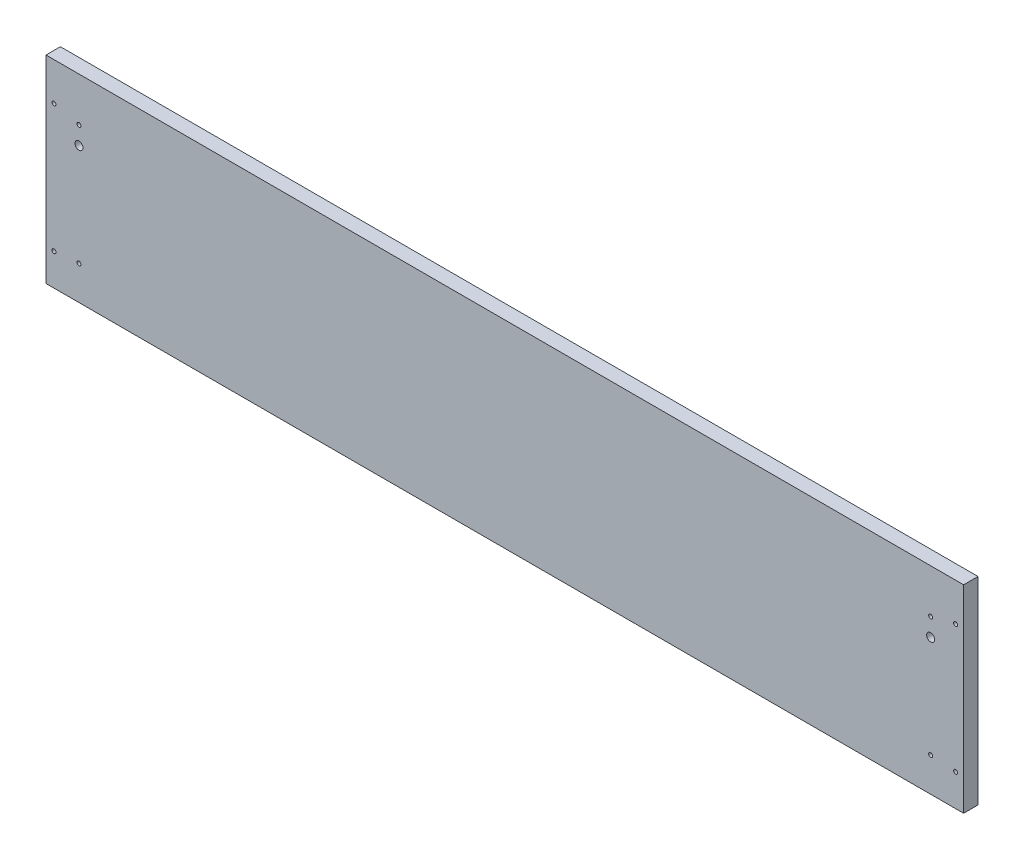
ISO-10303-21;
HEADER;
FILE_DESCRIPTION(('STEP AP214'),'2;1');
FILE_NAME('part.step','',(''),(''),'','','');
FILE_SCHEMA(('AUTOMOTIVE_DESIGN { 1 0 10303 214 1 1 1 1 }'));
ENDSEC;
DATA;
#1=APPLICATION_CONTEXT('core data for automotive mechanical design processes');
#2=APPLICATION_PROTOCOL_DEFINITION('international standard','automotive_design',2000,#1);
#3=PRODUCT_CONTEXT('',#1,'mechanical');
#4=PRODUCT('Part','Part','',(#3));
#5=PRODUCT_RELATED_PRODUCT_CATEGORY('part','',(#4));
#6=PRODUCT_DEFINITION_FORMATION('','',#4);
#7=PRODUCT_DEFINITION_CONTEXT('part definition',#1,'design');
#8=PRODUCT_DEFINITION('design','',#6,#7);
#9=PRODUCT_DEFINITION_SHAPE('','',#8);
#10=(LENGTH_UNIT() NAMED_UNIT(*) SI_UNIT(.MILLI.,.METRE.));
#11=(NAMED_UNIT(*) PLANE_ANGLE_UNIT() SI_UNIT($,.RADIAN.));
#12=(NAMED_UNIT(*) SI_UNIT($,.STERADIAN.) SOLID_ANGLE_UNIT());
#13=UNCERTAINTY_MEASURE_WITH_UNIT(LENGTH_MEASURE(1.E-05),#10,'distance_accuracy_value','');
#14=(GEOMETRIC_REPRESENTATION_CONTEXT(3) GLOBAL_UNCERTAINTY_ASSIGNED_CONTEXT((#13)) GLOBAL_UNIT_ASSIGNED_CONTEXT((#10,
#11,#12)) REPRESENTATION_CONTEXT('',''));
#15=CARTESIAN_POINT('',(0.,0.,0.));
#16=DIRECTION('',(0.,0.,1.));
#17=DIRECTION('',(1.,0.,0.));
#18=AXIS2_PLACEMENT_3D('',#15,#16,#17);
#19=CARTESIAN_POINT('',(-5740.4,1206.5,-11.43));
#20=DIRECTION('',(0.,-1.,0.));
#21=DIRECTION('',(0.,0.,-1.));
#22=AXIS2_PLACEMENT_3D('',#19,#20,#21);
#23=PLANE('',#22);
#24=DIRECTION('',(1.,0.,0.));
#25=VECTOR('',#24,1.);
#26=CARTESIAN_POINT('',(-5740.4,1206.5,0.));
#27=LINE('',#26,#25);
#28=CARTESIAN_POINT('',(-5740.4,1206.5,0.));
#29=VERTEX_POINT('',#28);
#30=CARTESIAN_POINT('',(-5011.7375,1206.5,0.));
#31=VERTEX_POINT('',#30);
#32=EDGE_CURVE('E96',#29,#31,#27,.T.);
#33=ORIENTED_EDGE('',*,*,#32,.F.);
#34=DIRECTION('',(0.,0.,1.));
#35=VECTOR('',#34,1.);
#36=CARTESIAN_POINT('',(-5740.4,1206.5,-11.43));
#37=LINE('',#36,#35);
#38=CARTESIAN_POINT('',(-5740.4,1206.5,-11.43));
#39=VERTEX_POINT('',#38);
#40=EDGE_CURVE('E11',#39,#29,#37,.T.);
#41=ORIENTED_EDGE('',*,*,#40,.F.);
#42=DIRECTION('',(1.,0.,0.));
#43=VECTOR('',#42,1.);
#44=CARTESIAN_POINT('',(-5740.4,1206.5,-11.43));
#45=LINE('',#44,#43);
#46=CARTESIAN_POINT('',(-5011.7375,1206.5,-11.43));
#47=VERTEX_POINT('',#46);
#48=EDGE_CURVE('E89',#39,#47,#45,.T.);
#49=ORIENTED_EDGE('',*,*,#48,.T.);
#50=DIRECTION('',(0.,0.,1.));
#51=VECTOR('',#50,1.);
#52=CARTESIAN_POINT('',(-5011.7375,1206.5,-11.43));
#53=LINE('',#52,#51);
#54=EDGE_CURVE('E34',#47,#31,#53,.T.);
#55=ORIENTED_EDGE('',*,*,#54,.T.);
#56=EDGE_LOOP('',(#33,#41,#49,#55));
#57=FACE_BOUND('',#56,.T.);
#58=ADVANCED_FACE('F31',(#57),#23,.T.);
#59=CARTESIAN_POINT('',(-5740.4,1363.6625,-11.43));
#60=DIRECTION('',(-1.,0.,0.));
#61=DIRECTION('',(0.,0.,1.));
#62=AXIS2_PLACEMENT_3D('',#59,#60,#61);
#63=PLANE('',#62);
#64=DIRECTION('',(0.,-1.,0.));
#65=VECTOR('',#64,1.);
#66=CARTESIAN_POINT('',(-5740.4,1363.6625,0.));
#67=LINE('',#66,#65);
#68=CARTESIAN_POINT('',(-5740.4,1363.6625,0.));
#69=VERTEX_POINT('',#68);
#70=EDGE_CURVE('E91',#69,#29,#67,.T.);
#71=ORIENTED_EDGE('',*,*,#70,.F.);
#72=DIRECTION('',(0.,0.,1.));
#73=VECTOR('',#72,1.);
#74=CARTESIAN_POINT('',(-5740.4,1363.6625,-11.43));
#75=LINE('',#74,#73);
#76=CARTESIAN_POINT('',(-5740.4,1363.6625,-11.43));
#77=VERTEX_POINT('',#76);
#78=EDGE_CURVE('E40',#77,#69,#75,.T.);
#79=ORIENTED_EDGE('',*,*,#78,.F.);
#80=DIRECTION('',(0.,-1.,0.));
#81=VECTOR('',#80,1.);
#82=CARTESIAN_POINT('',(-5740.4,1363.6625,-11.43));
#83=LINE('',#82,#81);
#84=EDGE_CURVE('E86',#77,#39,#83,.T.);
#85=ORIENTED_EDGE('',*,*,#84,.T.);
#86=ORIENTED_EDGE('',*,*,#40,.T.);
#87=EDGE_LOOP('',(#71,#79,#85,#86));
#88=FACE_BOUND('',#87,.T.);
#89=ADVANCED_FACE('F107',(#88),#63,.T.);
#90=CARTESIAN_POINT('',(-5011.7375,1363.6625,-11.43));
#91=DIRECTION('',(0.,1.,0.));
#92=DIRECTION('',(0.,0.,1.));
#93=AXIS2_PLACEMENT_3D('',#90,#91,#92);
#94=PLANE('',#93);
#95=DIRECTION('',(-1.,0.,0.));
#96=VECTOR('',#95,1.);
#97=CARTESIAN_POINT('',(-5011.7375,1363.6625,0.));
#98=LINE('',#97,#96);
#99=CARTESIAN_POINT('',(-5011.7375,1363.6625,0.));
#100=VERTEX_POINT('',#99);
#101=EDGE_CURVE('E81',#100,#69,#98,.T.);
#102=ORIENTED_EDGE('',*,*,#101,.F.);
#103=DIRECTION('',(0.,0.,1.));
#104=VECTOR('',#103,1.);
#105=CARTESIAN_POINT('',(-5011.7375,1363.6625,-11.43));
#106=LINE('',#105,#104);
#107=CARTESIAN_POINT('',(-5011.7375,1363.6625,-11.43));
#108=VERTEX_POINT('',#107);
#109=EDGE_CURVE('E76',#108,#100,#106,.T.);
#110=ORIENTED_EDGE('',*,*,#109,.F.);
#111=DIRECTION('',(-1.,0.,0.));
#112=VECTOR('',#111,1.);
#113=CARTESIAN_POINT('',(-5011.7375,1363.6625,-11.43));
#114=LINE('',#113,#112);
#115=EDGE_CURVE('E79',#108,#77,#114,.T.);
#116=ORIENTED_EDGE('',*,*,#115,.T.);
#117=ORIENTED_EDGE('',*,*,#78,.T.);
#118=EDGE_LOOP('',(#102,#110,#116,#117));
#119=FACE_BOUND('',#118,.T.);
#120=ADVANCED_FACE('F78',(#119),#94,.T.);
#121=CARTESIAN_POINT('',(-5011.7375,1206.5,-11.43));
#122=DIRECTION('',(1.,0.,0.));
#123=DIRECTION('',(0.,0.,-1.));
#124=AXIS2_PLACEMENT_3D('',#121,#122,#123);
#125=PLANE('',#124);
#126=DIRECTION('',(0.,1.,0.));
#127=VECTOR('',#126,1.);
#128=CARTESIAN_POINT('',(-5011.7375,1206.5,0.));
#129=LINE('',#128,#127);
#130=EDGE_CURVE('E99',#31,#100,#129,.T.);
#131=ORIENTED_EDGE('',*,*,#130,.F.);
#132=ORIENTED_EDGE('',*,*,#54,.F.);
#133=DIRECTION('',(0.,1.,0.));
#134=VECTOR('',#133,1.);
#135=CARTESIAN_POINT('',(-5011.7375,1206.5,-11.43));
#136=LINE('',#135,#134);
#137=EDGE_CURVE('E85',#47,#108,#136,.T.);
#138=ORIENTED_EDGE('',*,*,#137,.T.);
#139=ORIENTED_EDGE('',*,*,#109,.T.);
#140=EDGE_LOOP('',(#131,#132,#138,#139));
#141=FACE_BOUND('',#140,.T.);
#142=ADVANCED_FACE('F88',(#141),#125,.T.);
#143=CARTESIAN_POINT('',(-5011.7375,1206.5,-11.43));
#144=DIRECTION('',(0.,0.,1.));
#145=DIRECTION('',(1.,0.,0.));
#146=AXIS2_PLACEMENT_3D('',#143,#144,#145);
#147=PLANE('',#146);
#148=CARTESIAN_POINT('',(-5018.0875,1231.9,-11.43));
#149=DIRECTION('',(0.,0.,1.));
#150=DIRECTION('',(1.,0.,0.));
#151=AXIS2_PLACEMENT_3D('',#148,#149,#150);
#152=CIRCLE('',#151,1.58750000000051);
#153=CARTESIAN_POINT('',(-5016.5,1231.9,-11.43));
#154=VERTEX_POINT('',#153);
#155=EDGE_CURVE('E172',#154,#154,#152,.F.);
#156=ORIENTED_EDGE('',*,*,#155,.F.);
#157=EDGE_LOOP('',(#156));
#158=FACE_BOUND('',#157,.T.);
#159=CARTESIAN_POINT('',(-5037.93125,1233.4875,-11.43));
#160=DIRECTION('',(0.,0.,1.));
#161=DIRECTION('',(1.,0.,0.));
#162=AXIS2_PLACEMENT_3D('',#159,#160,#161);
#163=CIRCLE('',#162,1.58750000000051);
#164=CARTESIAN_POINT('',(-5036.34375,1233.4875,-11.43));
#165=VERTEX_POINT('',#164);
#166=EDGE_CURVE('E182',#165,#165,#163,.F.);
#167=ORIENTED_EDGE('',*,*,#166,.F.);
#168=EDGE_LOOP('',(#167));
#169=FACE_BOUND('',#168,.T.);
#170=CARTESIAN_POINT('',(-5018.0875,1333.5,-11.43));
#171=DIRECTION('',(0.,0.,1.));
#172=DIRECTION('',(1.,0.,0.));
#173=AXIS2_PLACEMENT_3D('',#170,#171,#172);
#174=CIRCLE('',#173,1.58750000000051);
#175=CARTESIAN_POINT('',(-5016.5,1333.5,-11.43));
#176=VERTEX_POINT('',#175);
#177=EDGE_CURVE('E188',#176,#176,#174,.F.);
#178=ORIENTED_EDGE('',*,*,#177,.F.);
#179=EDGE_LOOP('',(#178));
#180=FACE_BOUND('',#179,.T.);
#181=CARTESIAN_POINT('',(-5037.93125,1328.7375,-11.43));
#182=DIRECTION('',(0.,0.,1.));
#183=DIRECTION('',(1.,0.,0.));
#184=AXIS2_PLACEMENT_3D('',#181,#182,#183);
#185=CIRCLE('',#184,1.58750000000051);
#186=CARTESIAN_POINT('',(-5036.34375,1328.7375,-11.43));
#187=VERTEX_POINT('',#186);
#188=EDGE_CURVE('E194',#187,#187,#185,.F.);
#189=ORIENTED_EDGE('',*,*,#188,.F.);
#190=EDGE_LOOP('',(#189));
#191=FACE_BOUND('',#190,.T.);
#192=CARTESIAN_POINT('',(-5037.93125,1314.45,-11.43));
#193=DIRECTION('',(0.,0.,1.));
#194=DIRECTION('',(1.,0.,0.));
#195=AXIS2_PLACEMENT_3D('',#192,#193,#194);
#196=CIRCLE('',#195,3.17500000000004);
#197=CARTESIAN_POINT('',(-5034.75625,1314.45,-11.43));
#198=VERTEX_POINT('',#197);
#199=EDGE_CURVE('E200',#198,#198,#196,.F.);
#200=ORIENTED_EDGE('',*,*,#199,.F.);
#201=EDGE_LOOP('',(#200));
#202=FACE_BOUND('',#201,.T.);
#203=CARTESIAN_POINT('',(-5714.20625,1233.4875,-11.43));
#204=DIRECTION('',(0.,0.,1.));
#205=DIRECTION('',(1.,0.,0.));
#206=AXIS2_PLACEMENT_3D('',#203,#204,#205);
#207=CIRCLE('',#206,1.58750000000045);
#208=CARTESIAN_POINT('',(-5712.61875,1233.4875,-11.43));
#209=VERTEX_POINT('',#208);
#210=EDGE_CURVE('E206',#209,#209,#207,.F.);
#211=ORIENTED_EDGE('',*,*,#210,.F.);
#212=EDGE_LOOP('',(#211));
#213=FACE_BOUND('',#212,.T.);
#214=CARTESIAN_POINT('',(-5734.05,1231.9,-11.43));
#215=DIRECTION('',(0.,0.,1.));
#216=DIRECTION('',(1.,0.,0.));
#217=AXIS2_PLACEMENT_3D('',#214,#215,#216);
#218=CIRCLE('',#217,1.58750000000051);
#219=CARTESIAN_POINT('',(-5732.4625,1231.9,-11.43));
#220=VERTEX_POINT('',#219);
#221=EDGE_CURVE('E212',#220,#220,#218,.F.);
#222=ORIENTED_EDGE('',*,*,#221,.F.);
#223=EDGE_LOOP('',(#222));
#224=FACE_BOUND('',#223,.T.);
#225=CARTESIAN_POINT('',(-5734.05,1333.5,-11.43));
#226=DIRECTION('',(0.,0.,1.));
#227=DIRECTION('',(1.,0.,0.));
#228=AXIS2_PLACEMENT_3D('',#225,#226,#227);
#229=CIRCLE('',#228,1.58750000000051);
#230=CARTESIAN_POINT('',(-5732.4625,1333.5,-11.43));
#231=VERTEX_POINT('',#230);
#232=EDGE_CURVE('E218',#231,#231,#229,.F.);
#233=ORIENTED_EDGE('',*,*,#232,.F.);
#234=EDGE_LOOP('',(#233));
#235=FACE_BOUND('',#234,.T.);
#236=CARTESIAN_POINT('',(-5714.20625,1328.7375,-11.43));
#237=DIRECTION('',(0.,0.,1.));
#238=DIRECTION('',(1.,0.,0.));
#239=AXIS2_PLACEMENT_3D('',#236,#237,#238);
#240=CIRCLE('',#239,1.5874999999996);
#241=CARTESIAN_POINT('',(-5712.61875,1328.7375,-11.43));
#242=VERTEX_POINT('',#241);
#243=EDGE_CURVE('E224',#242,#242,#240,.F.);
#244=ORIENTED_EDGE('',*,*,#243,.F.);
#245=EDGE_LOOP('',(#244));
#246=FACE_BOUND('',#245,.T.);
#247=CARTESIAN_POINT('',(-5714.20625,1314.45,-11.43));
#248=DIRECTION('',(0.,0.,1.));
#249=DIRECTION('',(1.,0.,0.));
#250=AXIS2_PLACEMENT_3D('',#247,#248,#249);
#251=CIRCLE('',#250,3.1749999999992);
#252=CARTESIAN_POINT('',(-5711.03125,1314.45,-11.43));
#253=VERTEX_POINT('',#252);
#254=EDGE_CURVE('E100',#253,#253,#251,.F.);
#255=ORIENTED_EDGE('',*,*,#254,.F.);
#256=EDGE_LOOP('',(#255));
#257=FACE_BOUND('',#256,.T.);
#258=ORIENTED_EDGE('',*,*,#48,.F.);
#259=ORIENTED_EDGE('',*,*,#84,.F.);
#260=ORIENTED_EDGE('',*,*,#115,.F.);
#261=ORIENTED_EDGE('',*,*,#137,.F.);
#262=EDGE_LOOP('',(#258,#259,#260,#261));
#263=FACE_BOUND('',#262,.T.);
#264=ADVANCED_FACE('F84',(#158,#169,#180,#191,#202,#213,#224,#235,#246,#257,#263),#147,.F.);
#265=CARTESIAN_POINT('',(-5011.7375,1206.5,0.));
#266=DIRECTION('',(0.,0.,1.));
#267=DIRECTION('',(1.,0.,0.));
#268=AXIS2_PLACEMENT_3D('',#265,#266,#267);
#269=PLANE('',#268);
#270=CARTESIAN_POINT('',(-5018.0875,1231.9,0.));
#271=DIRECTION('',(0.,0.,1.));
#272=DIRECTION('',(1.,0.,0.));
#273=AXIS2_PLACEMENT_3D('',#270,#271,#272);
#274=CIRCLE('',#273,1.58750000000051);
#275=CARTESIAN_POINT('',(-5016.5,1231.9,0.));
#276=VERTEX_POINT('',#275);
#277=EDGE_CURVE('E175',#276,#276,#274,.T.);
#278=ORIENTED_EDGE('',*,*,#277,.F.);
#279=EDGE_LOOP('',(#278));
#280=FACE_BOUND('',#279,.T.);
#281=CARTESIAN_POINT('',(-5037.93125,1233.4875,0.));
#282=DIRECTION('',(0.,0.,1.));
#283=DIRECTION('',(1.,0.,0.));
#284=AXIS2_PLACEMENT_3D('',#281,#282,#283);
#285=CIRCLE('',#284,1.58750000000051);
#286=CARTESIAN_POINT('',(-5036.34375,1233.4875,0.));
#287=VERTEX_POINT('',#286);
#288=EDGE_CURVE('E177',#287,#287,#285,.T.);
#289=ORIENTED_EDGE('',*,*,#288,.F.);
#290=EDGE_LOOP('',(#289));
#291=FACE_BOUND('',#290,.T.);
#292=CARTESIAN_POINT('',(-5018.0875,1333.5,0.));
#293=DIRECTION('',(0.,0.,1.));
#294=DIRECTION('',(1.,0.,0.));
#295=AXIS2_PLACEMENT_3D('',#292,#293,#294);
#296=CIRCLE('',#295,1.58750000000051);
#297=CARTESIAN_POINT('',(-5016.5,1333.5,0.));
#298=VERTEX_POINT('',#297);
#299=EDGE_CURVE('E185',#298,#298,#296,.T.);
#300=ORIENTED_EDGE('',*,*,#299,.F.);
#301=EDGE_LOOP('',(#300));
#302=FACE_BOUND('',#301,.T.);
#303=CARTESIAN_POINT('',(-5037.93125,1328.7375,0.));
#304=DIRECTION('',(0.,0.,1.));
#305=DIRECTION('',(1.,0.,0.));
#306=AXIS2_PLACEMENT_3D('',#303,#304,#305);
#307=CIRCLE('',#306,1.58750000000051);
#308=CARTESIAN_POINT('',(-5036.34375,1328.7375,0.));
#309=VERTEX_POINT('',#308);
#310=EDGE_CURVE('E191',#309,#309,#307,.T.);
#311=ORIENTED_EDGE('',*,*,#310,.F.);
#312=EDGE_LOOP('',(#311));
#313=FACE_BOUND('',#312,.T.);
#314=CARTESIAN_POINT('',(-5037.93125,1314.45,0.));
#315=DIRECTION('',(0.,0.,1.));
#316=DIRECTION('',(1.,0.,0.));
#317=AXIS2_PLACEMENT_3D('',#314,#315,#316);
#318=CIRCLE('',#317,3.17500000000004);
#319=CARTESIAN_POINT('',(-5034.75625,1314.45,0.));
#320=VERTEX_POINT('',#319);
#321=EDGE_CURVE('E197',#320,#320,#318,.T.);
#322=ORIENTED_EDGE('',*,*,#321,.F.);
#323=EDGE_LOOP('',(#322));
#324=FACE_BOUND('',#323,.T.);
#325=CARTESIAN_POINT('',(-5714.20625,1233.4875,0.));
#326=DIRECTION('',(0.,0.,1.));
#327=DIRECTION('',(1.,0.,0.));
#328=AXIS2_PLACEMENT_3D('',#325,#326,#327);
#329=CIRCLE('',#328,1.58750000000045);
#330=CARTESIAN_POINT('',(-5712.61875,1233.4875,0.));
#331=VERTEX_POINT('',#330);
#332=EDGE_CURVE('E203',#331,#331,#329,.T.);
#333=ORIENTED_EDGE('',*,*,#332,.F.);
#334=EDGE_LOOP('',(#333));
#335=FACE_BOUND('',#334,.T.);
#336=CARTESIAN_POINT('',(-5734.05,1231.9,0.));
#337=DIRECTION('',(0.,0.,1.));
#338=DIRECTION('',(1.,0.,0.));
#339=AXIS2_PLACEMENT_3D('',#336,#337,#338);
#340=CIRCLE('',#339,1.58750000000051);
#341=CARTESIAN_POINT('',(-5732.4625,1231.9,0.));
#342=VERTEX_POINT('',#341);
#343=EDGE_CURVE('E209',#342,#342,#340,.T.);
#344=ORIENTED_EDGE('',*,*,#343,.F.);
#345=EDGE_LOOP('',(#344));
#346=FACE_BOUND('',#345,.T.);
#347=CARTESIAN_POINT('',(-5734.05,1333.5,0.));
#348=DIRECTION('',(0.,0.,1.));
#349=DIRECTION('',(1.,0.,0.));
#350=AXIS2_PLACEMENT_3D('',#347,#348,#349);
#351=CIRCLE('',#350,1.58750000000051);
#352=CARTESIAN_POINT('',(-5732.4625,1333.5,0.));
#353=VERTEX_POINT('',#352);
#354=EDGE_CURVE('E215',#353,#353,#351,.T.);
#355=ORIENTED_EDGE('',*,*,#354,.F.);
#356=EDGE_LOOP('',(#355));
#357=FACE_BOUND('',#356,.T.);
#358=CARTESIAN_POINT('',(-5714.20625,1328.7375,0.));
#359=DIRECTION('',(0.,0.,1.));
#360=DIRECTION('',(1.,0.,0.));
#361=AXIS2_PLACEMENT_3D('',#358,#359,#360);
#362=CIRCLE('',#361,1.5874999999996);
#363=CARTESIAN_POINT('',(-5712.61875,1328.7375,0.));
#364=VERTEX_POINT('',#363);
#365=EDGE_CURVE('E221',#364,#364,#362,.T.);
#366=ORIENTED_EDGE('',*,*,#365,.F.);
#367=EDGE_LOOP('',(#366));
#368=FACE_BOUND('',#367,.T.);
#369=CARTESIAN_POINT('',(-5714.20625,1314.45,0.));
#370=DIRECTION('',(0.,0.,1.));
#371=DIRECTION('',(1.,0.,0.));
#372=AXIS2_PLACEMENT_3D('',#369,#370,#371);
#373=CIRCLE('',#372,3.1749999999992);
#374=CARTESIAN_POINT('',(-5711.03125,1314.45,0.));
#375=VERTEX_POINT('',#374);
#376=EDGE_CURVE('E227',#375,#375,#373,.T.);
#377=ORIENTED_EDGE('',*,*,#376,.F.);
#378=EDGE_LOOP('',(#377));
#379=FACE_BOUND('',#378,.T.);
#380=ORIENTED_EDGE('',*,*,#32,.T.);
#381=ORIENTED_EDGE('',*,*,#130,.T.);
#382=ORIENTED_EDGE('',*,*,#101,.T.);
#383=ORIENTED_EDGE('',*,*,#70,.T.);
#384=EDGE_LOOP('',(#380,#381,#382,#383));
#385=FACE_BOUND('',#384,.T.);
#386=ADVANCED_FACE('F106',(#280,#291,#302,#313,#324,#335,#346,#357,#368,#379,#385),#269,.T.);
#387=CARTESIAN_POINT('',(-5714.20625,1314.45,-20.4102561210689));
#388=DIRECTION('',(0.,0.,1.));
#389=DIRECTION('',(1.,0.,0.));
#390=AXIS2_PLACEMENT_3D('',#387,#388,#389);
#391=CYLINDRICAL_SURFACE('',#390,3.1749999999992);
#392=ORIENTED_EDGE('',*,*,#254,.T.);
#393=EDGE_LOOP('',(#392));
#394=FACE_BOUND('',#393,.T.);
#395=ORIENTED_EDGE('',*,*,#376,.T.);
#396=EDGE_LOOP('',(#395));
#397=FACE_BOUND('',#396,.T.);
#398=ADVANCED_FACE('F125',(#394,#397),#391,.F.);
#399=CARTESIAN_POINT('',(-5714.20625,1328.7375,-20.4102561210689));
#400=DIRECTION('',(0.,0.,1.));
#401=DIRECTION('',(1.,0.,0.));
#402=AXIS2_PLACEMENT_3D('',#399,#400,#401);
#403=CYLINDRICAL_SURFACE('',#402,1.5874999999996);
#404=ORIENTED_EDGE('',*,*,#243,.T.);
#405=EDGE_LOOP('',(#404));
#406=FACE_BOUND('',#405,.T.);
#407=ORIENTED_EDGE('',*,*,#365,.T.);
#408=EDGE_LOOP('',(#407));
#409=FACE_BOUND('',#408,.T.);
#410=ADVANCED_FACE('F132',(#406,#409),#403,.F.);
#411=CARTESIAN_POINT('',(-5734.05,1333.5,-20.4102561210689));
#412=DIRECTION('',(0.,0.,1.));
#413=DIRECTION('',(1.,0.,0.));
#414=AXIS2_PLACEMENT_3D('',#411,#412,#413);
#415=CYLINDRICAL_SURFACE('',#414,1.58750000000051);
#416=ORIENTED_EDGE('',*,*,#232,.T.);
#417=EDGE_LOOP('',(#416));
#418=FACE_BOUND('',#417,.T.);
#419=ORIENTED_EDGE('',*,*,#354,.T.);
#420=EDGE_LOOP('',(#419));
#421=FACE_BOUND('',#420,.T.);
#422=ADVANCED_FACE('F136',(#418,#421),#415,.F.);
#423=CARTESIAN_POINT('',(-5734.05,1231.9,-20.4102561210689));
#424=DIRECTION('',(0.,0.,1.));
#425=DIRECTION('',(1.,0.,0.));
#426=AXIS2_PLACEMENT_3D('',#423,#424,#425);
#427=CYLINDRICAL_SURFACE('',#426,1.58750000000051);
#428=ORIENTED_EDGE('',*,*,#221,.T.);
#429=EDGE_LOOP('',(#428));
#430=FACE_BOUND('',#429,.T.);
#431=ORIENTED_EDGE('',*,*,#343,.T.);
#432=EDGE_LOOP('',(#431));
#433=FACE_BOUND('',#432,.T.);
#434=ADVANCED_FACE('F140',(#430,#433),#427,.F.);
#435=CARTESIAN_POINT('',(-5714.20625,1233.4875,-20.4102561210689));
#436=DIRECTION('',(0.,0.,1.));
#437=DIRECTION('',(1.,0.,0.));
#438=AXIS2_PLACEMENT_3D('',#435,#436,#437);
#439=CYLINDRICAL_SURFACE('',#438,1.58750000000045);
#440=ORIENTED_EDGE('',*,*,#210,.T.);
#441=EDGE_LOOP('',(#440));
#442=FACE_BOUND('',#441,.T.);
#443=ORIENTED_EDGE('',*,*,#332,.T.);
#444=EDGE_LOOP('',(#443));
#445=FACE_BOUND('',#444,.T.);
#446=ADVANCED_FACE('F144',(#442,#445),#439,.F.);
#447=CARTESIAN_POINT('',(-5037.93125,1314.45,-20.4102561210689));
#448=DIRECTION('',(0.,0.,1.));
#449=DIRECTION('',(1.,0.,0.));
#450=AXIS2_PLACEMENT_3D('',#447,#448,#449);
#451=CYLINDRICAL_SURFACE('',#450,3.17500000000004);
#452=ORIENTED_EDGE('',*,*,#199,.T.);
#453=EDGE_LOOP('',(#452));
#454=FACE_BOUND('',#453,.T.);
#455=ORIENTED_EDGE('',*,*,#321,.T.);
#456=EDGE_LOOP('',(#455));
#457=FACE_BOUND('',#456,.T.);
#458=ADVANCED_FACE('F148',(#454,#457),#451,.F.);
#459=CARTESIAN_POINT('',(-5037.93125,1328.7375,-20.4102561210689));
#460=DIRECTION('',(0.,0.,1.));
#461=DIRECTION('',(1.,0.,0.));
#462=AXIS2_PLACEMENT_3D('',#459,#460,#461);
#463=CYLINDRICAL_SURFACE('',#462,1.58750000000051);
#464=ORIENTED_EDGE('',*,*,#188,.T.);
#465=EDGE_LOOP('',(#464));
#466=FACE_BOUND('',#465,.T.);
#467=ORIENTED_EDGE('',*,*,#310,.T.);
#468=EDGE_LOOP('',(#467));
#469=FACE_BOUND('',#468,.T.);
#470=ADVANCED_FACE('F152',(#466,#469),#463,.F.);
#471=CARTESIAN_POINT('',(-5018.0875,1333.5,-20.4102561210689));
#472=DIRECTION('',(0.,0.,1.));
#473=DIRECTION('',(1.,0.,0.));
#474=AXIS2_PLACEMENT_3D('',#471,#472,#473);
#475=CYLINDRICAL_SURFACE('',#474,1.58750000000051);
#476=ORIENTED_EDGE('',*,*,#177,.T.);
#477=EDGE_LOOP('',(#476));
#478=FACE_BOUND('',#477,.T.);
#479=ORIENTED_EDGE('',*,*,#299,.T.);
#480=EDGE_LOOP('',(#479));
#481=FACE_BOUND('',#480,.T.);
#482=ADVANCED_FACE('F156',(#478,#481),#475,.F.);
#483=CARTESIAN_POINT('',(-5037.93125,1233.4875,-20.4102561210689));
#484=DIRECTION('',(0.,0.,1.));
#485=DIRECTION('',(1.,0.,0.));
#486=AXIS2_PLACEMENT_3D('',#483,#484,#485);
#487=CYLINDRICAL_SURFACE('',#486,1.58750000000051);
#488=ORIENTED_EDGE('',*,*,#166,.T.);
#489=EDGE_LOOP('',(#488));
#490=FACE_BOUND('',#489,.T.);
#491=ORIENTED_EDGE('',*,*,#288,.T.);
#492=EDGE_LOOP('',(#491));
#493=FACE_BOUND('',#492,.T.);
#494=ADVANCED_FACE('F160',(#490,#493),#487,.F.);
#495=CARTESIAN_POINT('',(-5018.0875,1231.9,-20.4102561210689));
#496=DIRECTION('',(0.,0.,1.));
#497=DIRECTION('',(1.,0.,0.));
#498=AXIS2_PLACEMENT_3D('',#495,#496,#497);
#499=CYLINDRICAL_SURFACE('',#498,1.58750000000051);
#500=ORIENTED_EDGE('',*,*,#155,.T.);
#501=EDGE_LOOP('',(#500));
#502=FACE_BOUND('',#501,.T.);
#503=ORIENTED_EDGE('',*,*,#277,.T.);
#504=EDGE_LOOP('',(#503));
#505=FACE_BOUND('',#504,.T.);
#506=ADVANCED_FACE('F164',(#502,#505),#499,.F.);
#507=CLOSED_SHELL('',(#58,#89,#120,#142,#264,#386,#398,#410,#422,#434,#446,#458,#470,#482,#494,#506));
#508=MANIFOLD_SOLID_BREP('B2',#507);
#509=ADVANCED_BREP_SHAPE_REPRESENTATION('',(#18,#508),#14);
#510=SHAPE_DEFINITION_REPRESENTATION(#9,#509);
ENDSEC;
END-ISO-10303-21;
